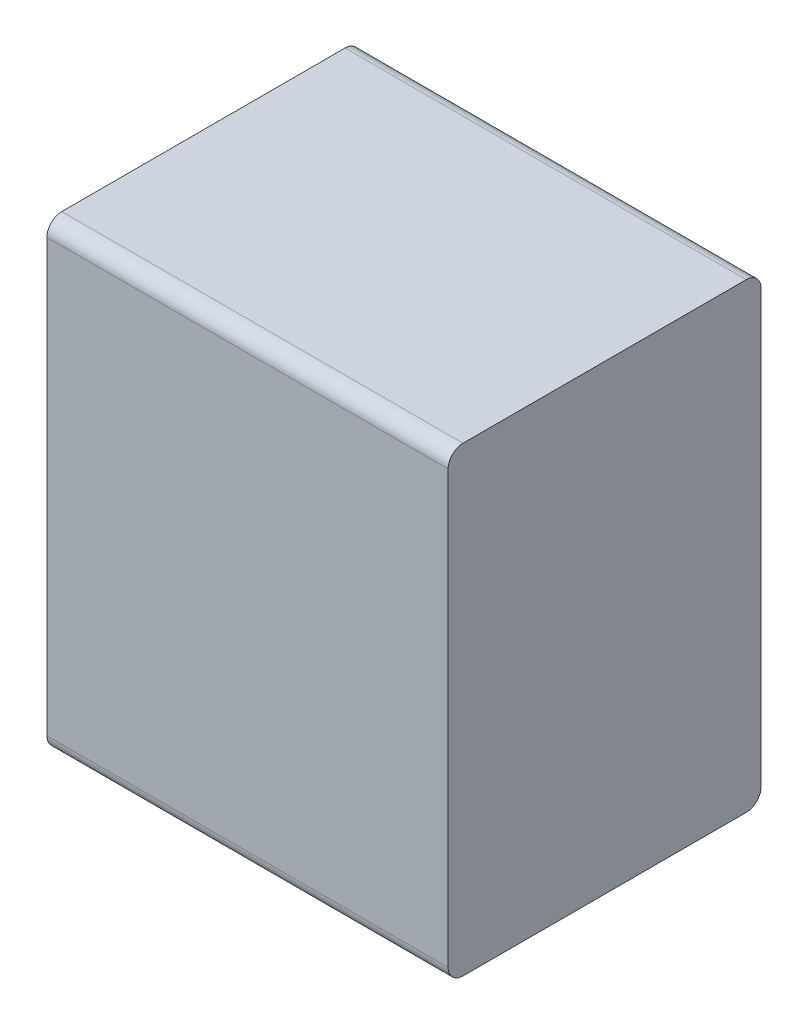
ISO-10303-21;
HEADER;
FILE_DESCRIPTION(('STEP AP214'),'2;1');
FILE_NAME('part.step','',(''),(''),'','','');
FILE_SCHEMA(('AUTOMOTIVE_DESIGN { 1 0 10303 214 1 1 1 1 }'));
ENDSEC;
DATA;
#1=APPLICATION_CONTEXT('core data for automotive mechanical design processes');
#2=APPLICATION_PROTOCOL_DEFINITION('international standard','automotive_design',2000,#1);
#3=PRODUCT_CONTEXT('',#1,'mechanical');
#4=PRODUCT('Part','Part','',(#3));
#5=PRODUCT_RELATED_PRODUCT_CATEGORY('part','',(#4));
#6=PRODUCT_DEFINITION_FORMATION('','',#4);
#7=PRODUCT_DEFINITION_CONTEXT('part definition',#1,'design');
#8=PRODUCT_DEFINITION('design','',#6,#7);
#9=PRODUCT_DEFINITION_SHAPE('','',#8);
#10=(LENGTH_UNIT() NAMED_UNIT(*) SI_UNIT(.MILLI.,.METRE.));
#11=(NAMED_UNIT(*) PLANE_ANGLE_UNIT() SI_UNIT($,.RADIAN.));
#12=(NAMED_UNIT(*) SI_UNIT($,.STERADIAN.) SOLID_ANGLE_UNIT());
#13=UNCERTAINTY_MEASURE_WITH_UNIT(LENGTH_MEASURE(1.E-05),#10,'distance_accuracy_value','');
#14=(GEOMETRIC_REPRESENTATION_CONTEXT(3) GLOBAL_UNCERTAINTY_ASSIGNED_CONTEXT((#13)) GLOBAL_UNIT_ASSIGNED_CONTEXT((#10,
#11,#12)) REPRESENTATION_CONTEXT('',''));
#15=CARTESIAN_POINT('',(0.,0.,0.));
#16=DIRECTION('',(0.,0.,1.));
#17=DIRECTION('',(1.,0.,0.));
#18=AXIS2_PLACEMENT_3D('',#15,#16,#17);
#19=CARTESIAN_POINT('',(-0.5,-0.575,0.05));
#20=DIRECTION('',(1.,0.,0.));
#21=DIRECTION('',(0.,0.,1.));
#22=AXIS2_PLACEMENT_3D('',#19,#20,#21);
#23=PLANE('',#22);
#24=CARTESIAN_POINT('',(-0.5,-0.538,0.793));
#25=DIRECTION('',(-1.,0.,0.));
#26=DIRECTION('',(0.,-1.,0.));
#27=AXIS2_PLACEMENT_3D('',#24,#25,#26);
#28=CIRCLE('',#27,0.037);
#29=CARTESIAN_POINT('',(-0.5,-0.575,0.793));
#30=VERTEX_POINT('',#29);
#31=CARTESIAN_POINT('',(-0.5,-0.538,0.83));
#32=VERTEX_POINT('',#31);
#33=EDGE_CURVE('E11',#30,#32,#28,.T.);
#34=ORIENTED_EDGE('',*,*,#33,.T.);
#35=DIRECTION('',(0.,1.,0.));
#36=VECTOR('',#35,1.);
#37=CARTESIAN_POINT('',(-0.5,-0.538,0.83));
#38=LINE('',#37,#36);
#39=CARTESIAN_POINT('',(-0.5,0.538,0.83));
#40=VERTEX_POINT('',#39);
#41=EDGE_CURVE('E142',#32,#40,#38,.T.);
#42=ORIENTED_EDGE('',*,*,#41,.T.);
#43=CARTESIAN_POINT('',(-0.5,0.538,0.793));
#44=DIRECTION('',(1.,0.,0.));
#45=DIRECTION('',(0.,1.,0.));
#46=AXIS2_PLACEMENT_3D('',#43,#44,#45);
#47=CIRCLE('',#46,0.037);
#48=CARTESIAN_POINT('',(-0.5,0.575,0.793));
#49=VERTEX_POINT('',#48);
#50=EDGE_CURVE('E136',#49,#40,#47,.T.);
#51=ORIENTED_EDGE('',*,*,#50,.F.);
#52=DIRECTION('',(0.,0.,1.));
#53=VECTOR('',#52,1.);
#54=CARTESIAN_POINT('',(-0.5,0.575,0.087));
#55=LINE('',#54,#53);
#56=CARTESIAN_POINT('',(-0.5,0.575,0.087));
#57=VERTEX_POINT('',#56);
#58=EDGE_CURVE('E97',#57,#49,#55,.T.);
#59=ORIENTED_EDGE('',*,*,#58,.F.);
#60=CARTESIAN_POINT('',(-0.5,0.538,0.087));
#61=DIRECTION('',(-1.,0.,0.));
#62=DIRECTION('',(0.,1.,0.));
#63=AXIS2_PLACEMENT_3D('',#60,#61,#62);
#64=CIRCLE('',#63,0.037);
#65=CARTESIAN_POINT('',(-0.5,0.538,0.05));
#66=VERTEX_POINT('',#65);
#67=EDGE_CURVE('E120',#57,#66,#64,.T.);
#68=ORIENTED_EDGE('',*,*,#67,.T.);
#69=DIRECTION('',(0.,1.,0.));
#70=VECTOR('',#69,1.);
#71=CARTESIAN_POINT('',(-0.5,-0.538,0.05));
#72=LINE('',#71,#70);
#73=CARTESIAN_POINT('',(-0.5,-0.538,0.05));
#74=VERTEX_POINT('',#73);
#75=EDGE_CURVE('E112',#74,#66,#72,.T.);
#76=ORIENTED_EDGE('',*,*,#75,.F.);
#77=CARTESIAN_POINT('',(-0.5,-0.538,0.087));
#78=DIRECTION('',(1.,0.,0.));
#79=DIRECTION('',(0.,-1.,0.));
#80=AXIS2_PLACEMENT_3D('',#77,#78,#79);
#81=CIRCLE('',#80,0.037);
#82=CARTESIAN_POINT('',(-0.5,-0.575,0.087));
#83=VERTEX_POINT('',#82);
#84=EDGE_CURVE('E140',#83,#74,#81,.T.);
#85=ORIENTED_EDGE('',*,*,#84,.F.);
#86=DIRECTION('',(0.,0.,1.));
#87=VECTOR('',#86,1.);
#88=CARTESIAN_POINT('',(-0.5,-0.575,0.087));
#89=LINE('',#88,#87);
#90=EDGE_CURVE('E138',#83,#30,#89,.T.);
#91=ORIENTED_EDGE('',*,*,#90,.T.);
#92=EDGE_LOOP('',(#34,#42,#51,#59,#68,#76,#85,#91));
#93=FACE_BOUND('',#92,.T.);
#94=ADVANCED_FACE('F17',(#93),#23,.F.);
#95=CARTESIAN_POINT('',(-0.5,-0.575,0.05));
#96=DIRECTION('',(0.,1.,0.));
#97=DIRECTION('',(0.,0.,1.));
#98=AXIS2_PLACEMENT_3D('',#95,#96,#97);
#99=PLANE('',#98);
#100=DIRECTION('',(1.,0.,0.));
#101=VECTOR('',#100,1.);
#102=CARTESIAN_POINT('',(-0.5,-0.575,0.793));
#103=LINE('',#102,#101);
#104=CARTESIAN_POINT('',(0.5,-0.575,0.793));
#105=VERTEX_POINT('',#104);
#106=EDGE_CURVE('E24',#30,#105,#103,.T.);
#107=ORIENTED_EDGE('',*,*,#106,.F.);
#108=ORIENTED_EDGE('',*,*,#90,.F.);
#109=DIRECTION('',(1.,0.,0.));
#110=VECTOR('',#109,1.);
#111=CARTESIAN_POINT('',(-0.5,-0.575,0.087));
#112=LINE('',#111,#110);
#113=CARTESIAN_POINT('',(0.5,-0.575,0.087));
#114=VERTEX_POINT('',#113);
#115=EDGE_CURVE('E132',#83,#114,#112,.T.);
#116=ORIENTED_EDGE('',*,*,#115,.T.);
#117=DIRECTION('',(0.,0.,1.));
#118=VECTOR('',#117,1.);
#119=CARTESIAN_POINT('',(0.5,-0.575,0.087));
#120=LINE('',#119,#118);
#121=EDGE_CURVE('E122',#114,#105,#120,.T.);
#122=ORIENTED_EDGE('',*,*,#121,.T.);
#123=EDGE_LOOP('',(#107,#108,#116,#122));
#124=FACE_BOUND('',#123,.T.);
#125=ADVANCED_FACE('F147',(#124),#99,.F.);
#126=CARTESIAN_POINT('',(-0.5,-0.538,0.087));
#127=DIRECTION('',(1.,0.,0.));
#128=DIRECTION('',(0.,-1.,0.));
#129=AXIS2_PLACEMENT_3D('',#126,#127,#128);
#130=CYLINDRICAL_SURFACE('',#129,0.037);
#131=ORIENTED_EDGE('',*,*,#84,.T.);
#132=DIRECTION('',(1.,0.,0.));
#133=VECTOR('',#132,1.);
#134=CARTESIAN_POINT('',(-0.5,-0.538,0.05));
#135=LINE('',#134,#133);
#136=CARTESIAN_POINT('',(0.5,-0.538,0.05));
#137=VERTEX_POINT('',#136);
#138=EDGE_CURVE('E134',#74,#137,#135,.T.);
#139=ORIENTED_EDGE('',*,*,#138,.T.);
#140=CARTESIAN_POINT('',(0.5,-0.538,0.087));
#141=DIRECTION('',(1.,0.,0.));
#142=DIRECTION('',(0.,-1.,0.));
#143=AXIS2_PLACEMENT_3D('',#140,#141,#142);
#144=CIRCLE('',#143,0.037);
#145=EDGE_CURVE('E124',#114,#137,#144,.T.);
#146=ORIENTED_EDGE('',*,*,#145,.F.);
#147=ORIENTED_EDGE('',*,*,#115,.F.);
#148=EDGE_LOOP('',(#131,#139,#146,#147));
#149=FACE_BOUND('',#148,.T.);
#150=ADVANCED_FACE('F163',(#149),#130,.T.);
#151=CARTESIAN_POINT('',(-0.5,-0.538,0.793));
#152=DIRECTION('',(1.,0.,0.));
#153=DIRECTION('',(0.,-1.,0.));
#154=AXIS2_PLACEMENT_3D('',#151,#152,#153);
#155=CYLINDRICAL_SURFACE('',#154,0.037);
#156=ORIENTED_EDGE('',*,*,#106,.T.);
#157=CARTESIAN_POINT('',(0.5,-0.538,0.793));
#158=DIRECTION('',(-1.,0.,0.));
#159=DIRECTION('',(0.,-1.,0.));
#160=AXIS2_PLACEMENT_3D('',#157,#158,#159);
#161=CIRCLE('',#160,0.037);
#162=CARTESIAN_POINT('',(0.5,-0.538,0.83));
#163=VERTEX_POINT('',#162);
#164=EDGE_CURVE('E127',#105,#163,#161,.T.);
#165=ORIENTED_EDGE('',*,*,#164,.T.);
#166=DIRECTION('',(1.,0.,0.));
#167=VECTOR('',#166,1.);
#168=CARTESIAN_POINT('',(-0.5,-0.538,0.83));
#169=LINE('',#168,#167);
#170=EDGE_CURVE('E115',#32,#163,#169,.T.);
#171=ORIENTED_EDGE('',*,*,#170,.F.);
#172=ORIENTED_EDGE('',*,*,#33,.F.);
#173=EDGE_LOOP('',(#156,#165,#171,#172));
#174=FACE_BOUND('',#173,.T.);
#175=ADVANCED_FACE('F144',(#174),#155,.T.);
#176=CARTESIAN_POINT('',(-0.5,-0.575,0.05));
#177=DIRECTION('',(0.,0.,1.));
#178=DIRECTION('',(1.,0.,0.));
#179=AXIS2_PLACEMENT_3D('',#176,#177,#178);
#180=PLANE('',#179);
#181=DIRECTION('',(1.,0.,0.));
#182=VECTOR('',#181,1.);
#183=CARTESIAN_POINT('',(-0.5,0.538,0.05));
#184=LINE('',#183,#182);
#185=CARTESIAN_POINT('',(0.5,0.538,0.05));
#186=VERTEX_POINT('',#185);
#187=EDGE_CURVE('E129',#66,#186,#184,.T.);
#188=ORIENTED_EDGE('',*,*,#187,.T.);
#189=DIRECTION('',(0.,1.,0.));
#190=VECTOR('',#189,1.);
#191=CARTESIAN_POINT('',(0.5,-0.538,0.05));
#192=LINE('',#191,#190);
#193=EDGE_CURVE('E118',#137,#186,#192,.T.);
#194=ORIENTED_EDGE('',*,*,#193,.F.);
#195=ORIENTED_EDGE('',*,*,#138,.F.);
#196=ORIENTED_EDGE('',*,*,#75,.T.);
#197=EDGE_LOOP('',(#188,#194,#195,#196));
#198=FACE_BOUND('',#197,.T.);
#199=ADVANCED_FACE('F159',(#198),#180,.F.);
#200=CARTESIAN_POINT('',(-0.5,-0.575,0.83));
#201=DIRECTION('',(0.,0.,1.));
#202=DIRECTION('',(1.,0.,0.));
#203=AXIS2_PLACEMENT_3D('',#200,#201,#202);
#204=PLANE('',#203);
#205=ORIENTED_EDGE('',*,*,#41,.F.);
#206=ORIENTED_EDGE('',*,*,#170,.T.);
#207=DIRECTION('',(0.,1.,0.));
#208=VECTOR('',#207,1.);
#209=CARTESIAN_POINT('',(0.5,-0.538,0.83));
#210=LINE('',#209,#208);
#211=CARTESIAN_POINT('',(0.5,0.538,0.83));
#212=VERTEX_POINT('',#211);
#213=EDGE_CURVE('E104',#163,#212,#210,.T.);
#214=ORIENTED_EDGE('',*,*,#213,.T.);
#215=DIRECTION('',(1.,0.,0.));
#216=VECTOR('',#215,1.);
#217=CARTESIAN_POINT('',(-0.5,0.538,0.83));
#218=LINE('',#217,#216);
#219=EDGE_CURVE('E85',#40,#212,#218,.T.);
#220=ORIENTED_EDGE('',*,*,#219,.F.);
#221=EDGE_LOOP('',(#205,#206,#214,#220));
#222=FACE_BOUND('',#221,.T.);
#223=ADVANCED_FACE('F151',(#222),#204,.T.);
#224=CARTESIAN_POINT('',(-0.5,0.538,0.087));
#225=DIRECTION('',(1.,0.,0.));
#226=DIRECTION('',(0.,1.,0.));
#227=AXIS2_PLACEMENT_3D('',#224,#225,#226);
#228=CYLINDRICAL_SURFACE('',#227,0.037);
#229=DIRECTION('',(1.,0.,0.));
#230=VECTOR('',#229,1.);
#231=CARTESIAN_POINT('',(-0.5,0.575,0.087));
#232=LINE('',#231,#230);
#233=CARTESIAN_POINT('',(0.5,0.575,0.087));
#234=VERTEX_POINT('',#233);
#235=EDGE_CURVE('E110',#57,#234,#232,.T.);
#236=ORIENTED_EDGE('',*,*,#235,.T.);
#237=CARTESIAN_POINT('',(0.5,0.538,0.087));
#238=DIRECTION('',(-1.,0.,0.));
#239=DIRECTION('',(0.,1.,0.));
#240=AXIS2_PLACEMENT_3D('',#237,#238,#239);
#241=CIRCLE('',#240,0.037);
#242=EDGE_CURVE('E103',#234,#186,#241,.T.);
#243=ORIENTED_EDGE('',*,*,#242,.T.);
#244=ORIENTED_EDGE('',*,*,#187,.F.);
#245=ORIENTED_EDGE('',*,*,#67,.F.);
#246=EDGE_LOOP('',(#236,#243,#244,#245));
#247=FACE_BOUND('',#246,.T.);
#248=ADVANCED_FACE('F156',(#247),#228,.T.);
#249=CARTESIAN_POINT('',(-0.5,0.538,0.793));
#250=DIRECTION('',(1.,0.,0.));
#251=DIRECTION('',(0.,1.,0.));
#252=AXIS2_PLACEMENT_3D('',#249,#250,#251);
#253=CYLINDRICAL_SURFACE('',#252,0.037);
#254=ORIENTED_EDGE('',*,*,#50,.T.);
#255=ORIENTED_EDGE('',*,*,#219,.T.);
#256=CARTESIAN_POINT('',(0.5,0.538,0.793));
#257=DIRECTION('',(1.,0.,0.));
#258=DIRECTION('',(0.,1.,0.));
#259=AXIS2_PLACEMENT_3D('',#256,#257,#258);
#260=CIRCLE('',#259,0.037);
#261=CARTESIAN_POINT('',(0.5,0.575,0.793));
#262=VERTEX_POINT('',#261);
#263=EDGE_CURVE('E79',#262,#212,#260,.T.);
#264=ORIENTED_EDGE('',*,*,#263,.F.);
#265=DIRECTION('',(1.,0.,0.));
#266=VECTOR('',#265,1.);
#267=CARTESIAN_POINT('',(-0.5,0.575,0.793));
#268=LINE('',#267,#266);
#269=EDGE_CURVE('E83',#49,#262,#268,.T.);
#270=ORIENTED_EDGE('',*,*,#269,.F.);
#271=EDGE_LOOP('',(#254,#255,#264,#270));
#272=FACE_BOUND('',#271,.T.);
#273=ADVANCED_FACE('F82',(#272),#253,.T.);
#274=CARTESIAN_POINT('',(-0.5,0.575,0.05));
#275=DIRECTION('',(0.,1.,0.));
#276=DIRECTION('',(0.,0.,1.));
#277=AXIS2_PLACEMENT_3D('',#274,#275,#276);
#278=PLANE('',#277);
#279=DIRECTION('',(0.,0.,1.));
#280=VECTOR('',#279,1.);
#281=CARTESIAN_POINT('',(0.5,0.575,0.087));
#282=LINE('',#281,#280);
#283=EDGE_CURVE('E95',#234,#262,#282,.T.);
#284=ORIENTED_EDGE('',*,*,#283,.F.);
#285=ORIENTED_EDGE('',*,*,#235,.F.);
#286=ORIENTED_EDGE('',*,*,#58,.T.);
#287=ORIENTED_EDGE('',*,*,#269,.T.);
#288=EDGE_LOOP('',(#284,#285,#286,#287));
#289=FACE_BOUND('',#288,.T.);
#290=ADVANCED_FACE('F93',(#289),#278,.T.);
#291=CARTESIAN_POINT('',(0.5,-0.575,0.05));
#292=DIRECTION('',(1.,0.,0.));
#293=DIRECTION('',(0.,0.,1.));
#294=AXIS2_PLACEMENT_3D('',#291,#292,#293);
#295=PLANE('',#294);
#296=ORIENTED_EDGE('',*,*,#121,.F.);
#297=ORIENTED_EDGE('',*,*,#145,.T.);
#298=ORIENTED_EDGE('',*,*,#193,.T.);
#299=ORIENTED_EDGE('',*,*,#242,.F.);
#300=ORIENTED_EDGE('',*,*,#283,.T.);
#301=ORIENTED_EDGE('',*,*,#263,.T.);
#302=ORIENTED_EDGE('',*,*,#213,.F.);
#303=ORIENTED_EDGE('',*,*,#164,.F.);
#304=EDGE_LOOP('',(#296,#297,#298,#299,#300,#301,#302,#303));
#305=FACE_BOUND('',#304,.T.);
#306=ADVANCED_FACE('F100',(#305),#295,.T.);
#307=CLOSED_SHELL('',(#94,#125,#150,#175,#199,#223,#248,#273,#290,#306));
#308=MANIFOLD_SOLID_BREP('B1',#307);
#309=ADVANCED_BREP_SHAPE_REPRESENTATION('',(#18,#308),#14);
#310=SHAPE_DEFINITION_REPRESENTATION(#9,#309);
ENDSEC;
END-ISO-10303-21;
